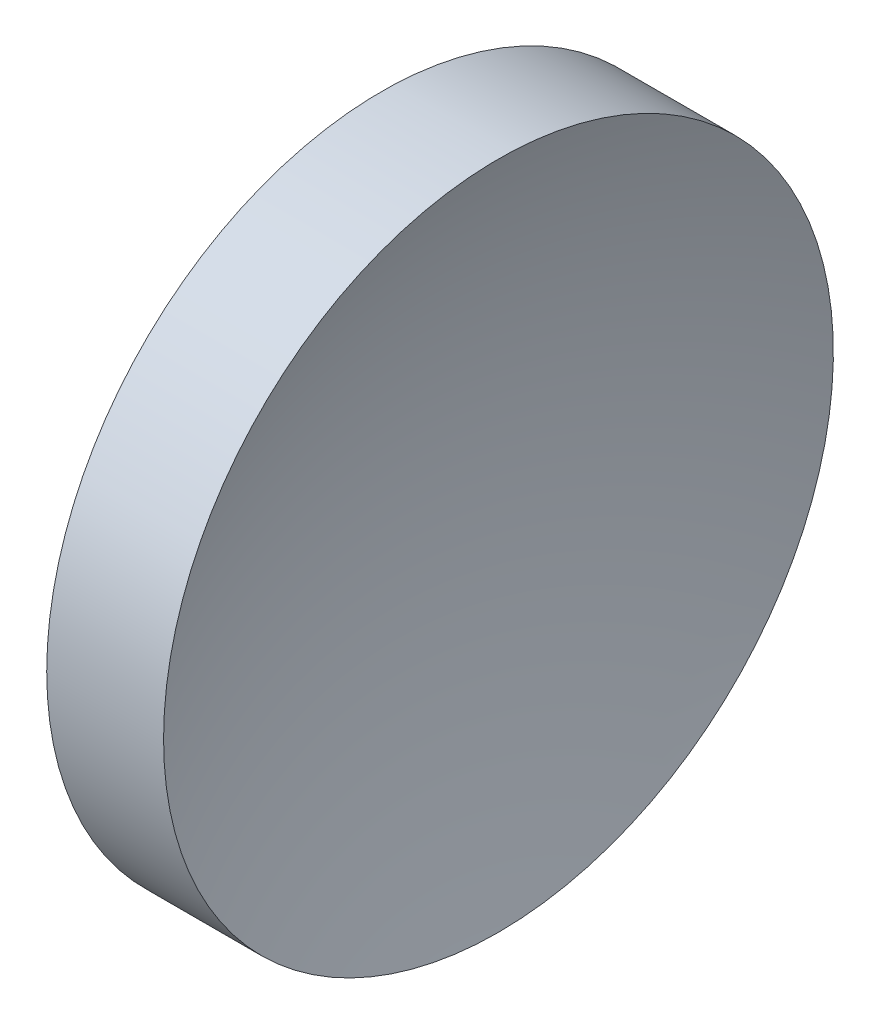
ISO-10303-21;
HEADER;
FILE_DESCRIPTION(('STEP AP214'),'2;1');
FILE_NAME('part.step','',(''),(''),'','','');
FILE_SCHEMA(('AUTOMOTIVE_DESIGN { 1 0 10303 214 1 1 1 1 }'));
ENDSEC;
DATA;
#1=APPLICATION_CONTEXT('core data for automotive mechanical design processes');
#2=APPLICATION_PROTOCOL_DEFINITION('international standard','automotive_design',2000,#1);
#3=PRODUCT_CONTEXT('',#1,'mechanical');
#4=PRODUCT('Part','Part','',(#3));
#5=PRODUCT_RELATED_PRODUCT_CATEGORY('part','',(#4));
#6=PRODUCT_DEFINITION_FORMATION('','',#4);
#7=PRODUCT_DEFINITION_CONTEXT('part definition',#1,'design');
#8=PRODUCT_DEFINITION('design','',#6,#7);
#9=PRODUCT_DEFINITION_SHAPE('','',#8);
#10=(LENGTH_UNIT() NAMED_UNIT(*) SI_UNIT(.MILLI.,.METRE.));
#11=(NAMED_UNIT(*) PLANE_ANGLE_UNIT() SI_UNIT($,.RADIAN.));
#12=(NAMED_UNIT(*) SI_UNIT($,.STERADIAN.) SOLID_ANGLE_UNIT());
#13=UNCERTAINTY_MEASURE_WITH_UNIT(LENGTH_MEASURE(1.E-05),#10,'distance_accuracy_value','');
#14=(GEOMETRIC_REPRESENTATION_CONTEXT(3) GLOBAL_UNCERTAINTY_ASSIGNED_CONTEXT((#13)) GLOBAL_UNIT_ASSIGNED_CONTEXT((#10,
#11,#12)) REPRESENTATION_CONTEXT('',''));
#15=CARTESIAN_POINT('',(0.,0.,0.));
#16=DIRECTION('',(0.,0.,1.));
#17=DIRECTION('',(1.,0.,0.));
#18=AXIS2_PLACEMENT_3D('',#15,#16,#17);
#19=CARTESIAN_POINT('',(155.752930792035,71.1939890865937,0.));
#20=DIRECTION('',(-1.,0.,0.));
#21=DIRECTION('',(0.,-1.,0.));
#22=AXIS2_PLACEMENT_3D('',#19,#20,#21);
#23=SPHERICAL_SURFACE('',#22,34.39);
#24=CARTESIAN_POINT('',(123.793861656655,71.1939890865937,0.));
#25=DIRECTION('',(-1.,0.,0.));
#26=DIRECTION('',(0.,0.,1.));
#27=AXIS2_PLACEMENT_3D('',#24,#25,#26);
#28=CIRCLE('',#27,12.7);
#29=CARTESIAN_POINT('',(123.793861656655,71.1939890865937,12.7));
#30=VERTEX_POINT('',#29);
#31=EDGE_CURVE('E10',#30,#30,#28,.T.);
#32=ORIENTED_EDGE('',*,*,#31,.F.);
#33=EDGE_LOOP('',(#32));
#34=FACE_BOUND('',#33,.T.);
#35=ADVANCED_FACE('F35',(#34),#23,.F.);
#36=CARTESIAN_POINT('',(111.955229757561,71.1939890865937,0.));
#37=DIRECTION('',(-1.,0.,0.));
#38=DIRECTION('',(0.,0.,1.));
#39=AXIS2_PLACEMENT_3D('',#36,#37,#38);
#40=CYLINDRICAL_SURFACE('',#39,12.7);
#41=CARTESIAN_POINT('',(119.362930792035,71.1939890865937,0.));
#42=DIRECTION('',(-1.,0.,0.));
#43=DIRECTION('',(0.,0.,1.));
#44=AXIS2_PLACEMENT_3D('',#41,#42,#43);
#45=CIRCLE('',#44,12.7);
#46=CARTESIAN_POINT('',(119.362930792035,71.1939890865937,12.7));
#47=VERTEX_POINT('',#46);
#48=EDGE_CURVE('E41',#47,#47,#45,.T.);
#49=ORIENTED_EDGE('',*,*,#48,.F.);
#50=EDGE_LOOP('',(#49));
#51=FACE_BOUND('',#50,.T.);
#52=ORIENTED_EDGE('',*,*,#31,.T.);
#53=EDGE_LOOP('',(#52));
#54=FACE_BOUND('',#53,.T.);
#55=ADVANCED_FACE('F49',(#51,#54),#40,.T.);
#56=CARTESIAN_POINT('',(119.362930792035,71.1939890865937,0.));
#57=DIRECTION('',(1.,0.,0.));
#58=DIRECTION('',(0.,0.,-1.));
#59=AXIS2_PLACEMENT_3D('',#56,#57,#58);
#60=PLANE('',#59);
#61=ORIENTED_EDGE('',*,*,#48,.T.);
#62=EDGE_LOOP('',(#61));
#63=FACE_BOUND('',#62,.T.);
#64=ADVANCED_FACE('F47',(#63),#60,.F.);
#65=CLOSED_SHELL('',(#35,#55,#64));
#66=MANIFOLD_SOLID_BREP('B2',#65);
#67=ADVANCED_BREP_SHAPE_REPRESENTATION('',(#18,#66),#14);
#68=SHAPE_DEFINITION_REPRESENTATION(#9,#67);
ENDSEC;
END-ISO-10303-21;
